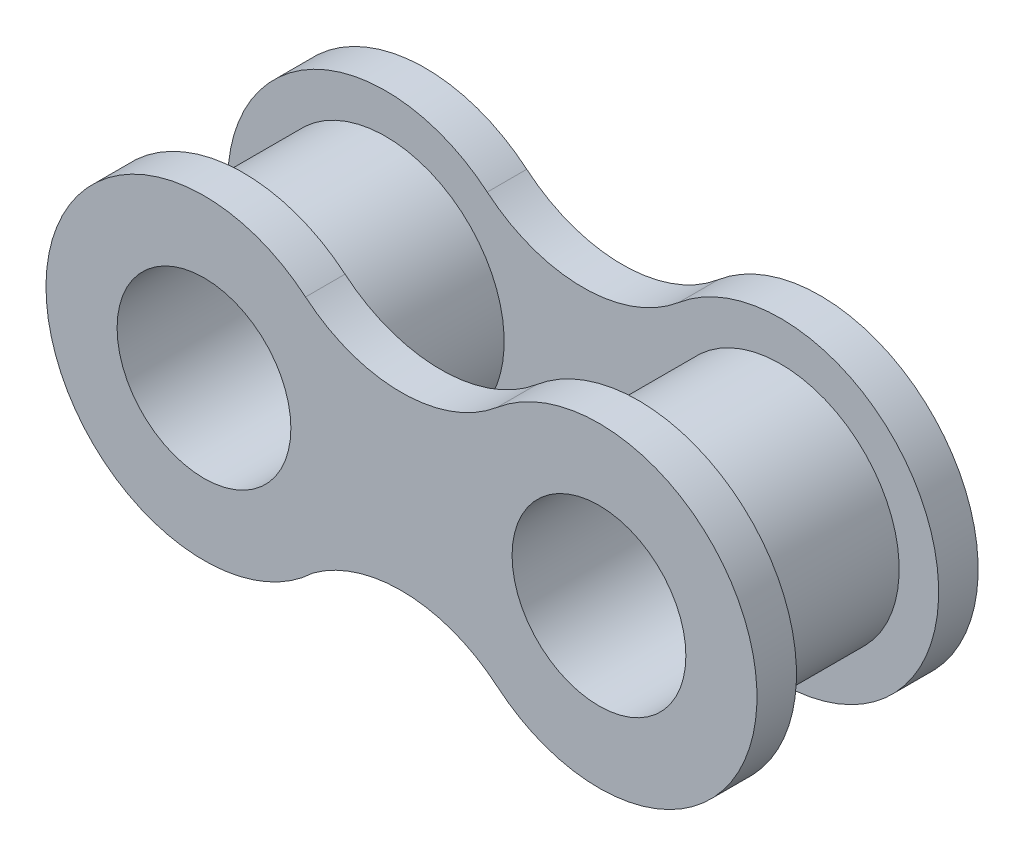
ISO-10303-21;
HEADER;
FILE_DESCRIPTION(('STEP AP214'),'2;1');
FILE_NAME('part.step','',(''),(''),'','','');
FILE_SCHEMA(('AUTOMOTIVE_DESIGN { 1 0 10303 214 1 1 1 1 }'));
ENDSEC;
DATA;
#1=APPLICATION_CONTEXT('core data for automotive mechanical design processes');
#2=APPLICATION_PROTOCOL_DEFINITION('international standard','automotive_design',2000,#1);
#3=PRODUCT_CONTEXT('',#1,'mechanical');
#4=PRODUCT('Part','Part','',(#3));
#5=PRODUCT_RELATED_PRODUCT_CATEGORY('part','',(#4));
#6=PRODUCT_DEFINITION_FORMATION('','',#4);
#7=PRODUCT_DEFINITION_CONTEXT('part definition',#1,'design');
#8=PRODUCT_DEFINITION('design','',#6,#7);
#9=PRODUCT_DEFINITION_SHAPE('','',#8);
#10=(LENGTH_UNIT() NAMED_UNIT(*) SI_UNIT(.MILLI.,.METRE.));
#11=(NAMED_UNIT(*) PLANE_ANGLE_UNIT() SI_UNIT($,.RADIAN.));
#12=(NAMED_UNIT(*) SI_UNIT($,.STERADIAN.) SOLID_ANGLE_UNIT());
#13=UNCERTAINTY_MEASURE_WITH_UNIT(LENGTH_MEASURE(1.E-05),#10,'distance_accuracy_value','');
#14=(GEOMETRIC_REPRESENTATION_CONTEXT(3) GLOBAL_UNCERTAINTY_ASSIGNED_CONTEXT((#13)) GLOBAL_UNIT_ASSIGNED_CONTEXT((#10,
#11,#12)) REPRESENTATION_CONTEXT('',''));
#15=CARTESIAN_POINT('',(0.,0.,0.));
#16=DIRECTION('',(0.,0.,1.));
#17=DIRECTION('',(1.,0.,0.));
#18=AXIS2_PLACEMENT_3D('',#15,#16,#17);
#19=CARTESIAN_POINT('',(-19.9369439531187,-13.6852790535894,1.27));
#20=DIRECTION('',(0.,0.,-1.));
#21=DIRECTION('',(-1.,0.,0.));
#22=AXIS2_PLACEMENT_3D('',#19,#20,#21);
#23=PLANE('',#22);
#24=CARTESIAN_POINT('',(-16.757896645419,-9.91445041401466,1.27));
#25=DIRECTION('',(0.,0.,-1.));
#26=DIRECTION('',(-1.,0.,0.));
#27=AXIS2_PLACEMENT_3D('',#24,#25,#26);
#28=CIRCLE('',#27,3.81);
#29=CARTESIAN_POINT('',(-20.567896645419,-9.91445041401466,1.27));
#30=VERTEX_POINT('',#29);
#31=EDGE_CURVE('E43',#30,#30,#28,.F.);
#32=ORIENTED_EDGE('',*,*,#31,.F.);
#33=EDGE_LOOP('',(#32));
#34=FACE_BOUND('',#33,.T.);
#35=CARTESIAN_POINT('',(-23.1159912608184,-17.4561076931641,1.27));
#36=DIRECTION('',(0.,0.,-1.));
#37=DIRECTION('',(-1.,0.,0.));
#38=AXIS2_PLACEMENT_3D('',#35,#36,#37);
#39=CIRCLE('',#38,4.784175670299);
#40=CARTESIAN_POINT('',(-25.9463960874436,-13.5990174217681,1.27));
#41=VERTEX_POINT('',#40);
#42=CARTESIAN_POINT('',(-20.0322828410624,-13.7983653257731,1.27));
#43=VERTEX_POINT('',#42);
#44=EDGE_CURVE('E162',#41,#43,#39,.T.);
#45=ORIENTED_EDGE('',*,*,#44,.T.);
#46=CARTESIAN_POINT('',(-16.757896645419,-9.91445041401466,1.27));
#47=DIRECTION('',(0.,0.,1.));
#48=DIRECTION('',(1.,0.,0.));
#49=AXIS2_PLACEMENT_3D('',#46,#47,#48);
#50=CIRCLE('',#49,5.08);
#51=CARTESIAN_POINT('',(-20.0322828410624,-6.03053550225622,1.27));
#52=VERTEX_POINT('',#51);
#53=EDGE_CURVE('E83',#43,#52,#50,.T.);
#54=ORIENTED_EDGE('',*,*,#53,.T.);
#55=CARTESIAN_POINT('',(-23.1159912608184,-2.37279313486525,1.27));
#56=DIRECTION('',(0.,0.,-1.));
#57=DIRECTION('',(1.,0.,0.));
#58=AXIS2_PLACEMENT_3D('',#55,#56,#57);
#59=CIRCLE('',#58,4.784175670299);
#60=CARTESIAN_POINT('',(-26.1918442760488,-6.03714370119743,1.27));
#61=VERTEX_POINT('',#60);
#62=EDGE_CURVE('E165',#52,#61,#59,.T.);
#63=ORIENTED_EDGE('',*,*,#62,.T.);
#64=CARTESIAN_POINT('',(-29.4578893367215,-9.9280754227335,1.27));
#65=DIRECTION('',(0.,0.,1.));
#66=DIRECTION('',(1.,0.,0.));
#67=AXIS2_PLACEMENT_3D('',#64,#65,#66);
#68=CIRCLE('',#67,5.08);
#69=EDGE_CURVE('E51',#61,#41,#68,.T.);
#70=ORIENTED_EDGE('',*,*,#69,.T.);
#71=EDGE_LOOP('',(#45,#54,#63,#70));
#72=FACE_BOUND('',#71,.T.);
#73=CARTESIAN_POINT('',(-29.4578893367215,-9.9280754227335,1.27));
#74=DIRECTION('',(0.,0.,-1.));
#75=DIRECTION('',(-1.,0.,0.));
#76=AXIS2_PLACEMENT_3D('',#73,#74,#75);
#77=CIRCLE('',#76,3.81);
#78=CARTESIAN_POINT('',(-33.2678893367215,-9.9280754227335,1.27));
#79=VERTEX_POINT('',#78);
#80=EDGE_CURVE('E11',#79,#79,#77,.F.);
#81=ORIENTED_EDGE('',*,*,#80,.F.);
#82=EDGE_LOOP('',(#81));
#83=FACE_BOUND('',#82,.T.);
#84=ADVANCED_FACE('F34',(#34,#72,#83),#23,.F.);
#85=CARTESIAN_POINT('',(-23.1159912608184,-17.4561076931641,1.27));
#86=DIRECTION('',(0.,0.,-1.));
#87=DIRECTION('',(-1.,0.,0.));
#88=AXIS2_PLACEMENT_3D('',#85,#86,#87);
#89=CYLINDRICAL_SURFACE('',#88,4.784175670299);
#90=CARTESIAN_POINT('',(-23.1159912608184,-17.4561076931641,0.));
#91=DIRECTION('',(0.,0.,-1.));
#92=DIRECTION('',(-1.,0.,0.));
#93=AXIS2_PLACEMENT_3D('',#90,#91,#92);
#94=CIRCLE('',#93,4.784175670299);
#95=CARTESIAN_POINT('',(-25.9463960874436,-13.5990174217681,0.));
#96=VERTEX_POINT('',#95);
#97=CARTESIAN_POINT('',(-20.0322828410624,-13.7983653257731,0.));
#98=VERTEX_POINT('',#97);
#99=EDGE_CURVE('E161',#96,#98,#94,.T.);
#100=ORIENTED_EDGE('',*,*,#99,.T.);
#101=DIRECTION('',(0.,0.,-1.));
#102=VECTOR('',#101,1.);
#103=CARTESIAN_POINT('',(-20.0322828410624,-13.7983653257731,1.27));
#104=LINE('',#103,#102);
#105=EDGE_CURVE('E180',#43,#98,#104,.T.);
#106=ORIENTED_EDGE('',*,*,#105,.F.);
#107=ORIENTED_EDGE('',*,*,#44,.F.);
#108=DIRECTION('',(0.,0.,-1.));
#109=VECTOR('',#108,1.);
#110=CARTESIAN_POINT('',(-25.9463960874436,-13.5990174217681,1.27));
#111=LINE('',#110,#109);
#112=EDGE_CURVE('E168',#41,#96,#111,.T.);
#113=ORIENTED_EDGE('',*,*,#112,.T.);
#114=EDGE_LOOP('',(#100,#106,#107,#113));
#115=FACE_BOUND('',#114,.T.);
#116=ADVANCED_FACE('F36',(#115),#89,.F.);
#117=CARTESIAN_POINT('',(-16.757896645419,-9.91445041401466,1.27));
#118=DIRECTION('',(0.,0.,-1.));
#119=DIRECTION('',(-1.,0.,0.));
#120=AXIS2_PLACEMENT_3D('',#117,#118,#119);
#121=CYLINDRICAL_SURFACE('',#120,5.08);
#122=CARTESIAN_POINT('',(-16.757896645419,-9.91445041401466,0.));
#123=DIRECTION('',(0.,0.,1.));
#124=DIRECTION('',(1.,0.,0.));
#125=AXIS2_PLACEMENT_3D('',#122,#123,#124);
#126=CIRCLE('',#125,5.08);
#127=CARTESIAN_POINT('',(-20.0322828410624,-6.03053550225622,0.));
#128=VERTEX_POINT('',#127);
#129=EDGE_CURVE('E171',#98,#128,#126,.T.);
#130=ORIENTED_EDGE('',*,*,#129,.T.);
#131=DIRECTION('',(0.,0.,-1.));
#132=VECTOR('',#131,1.);
#133=CARTESIAN_POINT('',(-20.0322828410624,-6.03053550225622,1.27));
#134=LINE('',#133,#132);
#135=EDGE_CURVE('E178',#52,#128,#134,.T.);
#136=ORIENTED_EDGE('',*,*,#135,.F.);
#137=ORIENTED_EDGE('',*,*,#53,.F.);
#138=ORIENTED_EDGE('',*,*,#105,.T.);
#139=EDGE_LOOP('',(#130,#136,#137,#138));
#140=FACE_BOUND('',#139,.T.);
#141=ADVANCED_FACE('F218',(#140),#121,.T.);
#142=CARTESIAN_POINT('',(-23.1159912608184,-2.37279313486525,1.27));
#143=DIRECTION('',(0.,0.,-1.));
#144=DIRECTION('',(-1.,0.,0.));
#145=AXIS2_PLACEMENT_3D('',#142,#143,#144);
#146=CYLINDRICAL_SURFACE('',#145,4.784175670299);
#147=CARTESIAN_POINT('',(-23.1159912608184,-2.37279313486525,0.));
#148=DIRECTION('',(0.,0.,-1.));
#149=DIRECTION('',(1.,0.,0.));
#150=AXIS2_PLACEMENT_3D('',#147,#148,#149);
#151=CIRCLE('',#150,4.784175670299);
#152=CARTESIAN_POINT('',(-26.1918442760488,-6.03714370119743,0.));
#153=VERTEX_POINT('',#152);
#154=EDGE_CURVE('E69',#128,#153,#151,.T.);
#155=ORIENTED_EDGE('',*,*,#154,.T.);
#156=DIRECTION('',(0.,0.,-1.));
#157=VECTOR('',#156,1.);
#158=CARTESIAN_POINT('',(-26.1918442760488,-6.03714370119743,1.27));
#159=LINE('',#158,#157);
#160=EDGE_CURVE('E176',#61,#153,#159,.T.);
#161=ORIENTED_EDGE('',*,*,#160,.F.);
#162=ORIENTED_EDGE('',*,*,#62,.F.);
#163=ORIENTED_EDGE('',*,*,#135,.T.);
#164=EDGE_LOOP('',(#155,#161,#162,#163));
#165=FACE_BOUND('',#164,.T.);
#166=ADVANCED_FACE('F216',(#165),#146,.F.);
#167=CARTESIAN_POINT('',(-29.4578893367215,-9.9280754227335,1.27));
#168=DIRECTION('',(0.,0.,-1.));
#169=DIRECTION('',(-1.,0.,0.));
#170=AXIS2_PLACEMENT_3D('',#167,#168,#169);
#171=CYLINDRICAL_SURFACE('',#170,5.08);
#172=CARTESIAN_POINT('',(-29.4578893367215,-9.9280754227335,0.));
#173=DIRECTION('',(0.,0.,1.));
#174=DIRECTION('',(1.,0.,0.));
#175=AXIS2_PLACEMENT_3D('',#172,#173,#174);
#176=CIRCLE('',#175,5.08);
#177=EDGE_CURVE('E75',#153,#96,#176,.T.);
#178=ORIENTED_EDGE('',*,*,#177,.T.);
#179=ORIENTED_EDGE('',*,*,#112,.F.);
#180=ORIENTED_EDGE('',*,*,#69,.F.);
#181=ORIENTED_EDGE('',*,*,#160,.T.);
#182=EDGE_LOOP('',(#178,#179,#180,#181));
#183=FACE_BOUND('',#182,.T.);
#184=ADVANCED_FACE('F212',(#183),#171,.T.);
#185=CARTESIAN_POINT('',(-19.9369439531187,-13.6852790535894,0.));
#186=DIRECTION('',(0.,0.,-1.));
#187=DIRECTION('',(-1.,0.,0.));
#188=AXIS2_PLACEMENT_3D('',#185,#186,#187);
#189=PLANE('',#188);
#190=CARTESIAN_POINT('',(-16.757896645419,-9.91445041401466,0.));
#191=DIRECTION('',(0.,0.,-1.));
#192=DIRECTION('',(-1.,0.,0.));
#193=AXIS2_PLACEMENT_3D('',#190,#191,#192);
#194=CIRCLE('',#193,2.794);
#195=CARTESIAN_POINT('',(-19.551896645419,-9.91445041401466,0.));
#196=VERTEX_POINT('',#195);
#197=EDGE_CURVE('E330',#196,#196,#194,.T.);
#198=ORIENTED_EDGE('',*,*,#197,.F.);
#199=EDGE_LOOP('',(#198));
#200=FACE_BOUND('',#199,.T.);
#201=CARTESIAN_POINT('',(-29.4578893367215,-9.9280754227335,0.));
#202=DIRECTION('',(0.,0.,-1.));
#203=DIRECTION('',(-1.,0.,0.));
#204=AXIS2_PLACEMENT_3D('',#201,#202,#203);
#205=CIRCLE('',#204,2.794);
#206=CARTESIAN_POINT('',(-32.2518893367215,-9.9280754227335,0.));
#207=VERTEX_POINT('',#206);
#208=EDGE_CURVE('E145',#207,#207,#205,.T.);
#209=ORIENTED_EDGE('',*,*,#208,.F.);
#210=EDGE_LOOP('',(#209));
#211=FACE_BOUND('',#210,.T.);
#212=ORIENTED_EDGE('',*,*,#99,.F.);
#213=ORIENTED_EDGE('',*,*,#177,.F.);
#214=ORIENTED_EDGE('',*,*,#154,.F.);
#215=ORIENTED_EDGE('',*,*,#129,.F.);
#216=EDGE_LOOP('',(#212,#213,#214,#215));
#217=FACE_BOUND('',#216,.T.);
#218=ADVANCED_FACE('F203',(#200,#211,#217),#189,.T.);
#219=CARTESIAN_POINT('',(-16.757896645419,-9.91445041401466,5.842));
#220=DIRECTION('',(0.,0.,-1.));
#221=DIRECTION('',(-1.,0.,0.));
#222=AXIS2_PLACEMENT_3D('',#219,#220,#221);
#223=CYLINDRICAL_SURFACE('',#222,3.81);
#224=CARTESIAN_POINT('',(-16.757896645419,-9.91445041401466,5.842));
#225=DIRECTION('',(0.,0.,1.));
#226=DIRECTION('',(1.,0.,0.));
#227=AXIS2_PLACEMENT_3D('',#224,#225,#226);
#228=CIRCLE('',#227,3.81);
#229=CARTESIAN_POINT('',(-12.947896645419,-9.91445041401466,5.842));
#230=VERTEX_POINT('',#229);
#231=EDGE_CURVE('E158',#230,#230,#228,.T.);
#232=ORIENTED_EDGE('',*,*,#231,.F.);
#233=EDGE_LOOP('',(#232));
#234=FACE_BOUND('',#233,.T.);
#235=ORIENTED_EDGE('',*,*,#31,.T.);
#236=EDGE_LOOP('',(#235));
#237=FACE_BOUND('',#236,.T.);
#238=ADVANCED_FACE('F184',(#234,#237),#223,.T.);
#239=CARTESIAN_POINT('',(-29.4578893367215,-9.9280754227335,5.842));
#240=DIRECTION('',(0.,0.,-1.));
#241=DIRECTION('',(-1.,0.,0.));
#242=AXIS2_PLACEMENT_3D('',#239,#240,#241);
#243=CYLINDRICAL_SURFACE('',#242,3.81);
#244=CARTESIAN_POINT('',(-29.4578893367215,-9.9280754227335,5.842));
#245=DIRECTION('',(0.,0.,1.));
#246=DIRECTION('',(1.,0.,0.));
#247=AXIS2_PLACEMENT_3D('',#244,#245,#246);
#248=CIRCLE('',#247,3.81);
#249=CARTESIAN_POINT('',(-25.6478893367215,-9.9280754227335,5.842));
#250=VERTEX_POINT('',#249);
#251=EDGE_CURVE('E121',#250,#250,#248,.T.);
#252=ORIENTED_EDGE('',*,*,#251,.F.);
#253=EDGE_LOOP('',(#252));
#254=FACE_BOUND('',#253,.T.);
#255=ORIENTED_EDGE('',*,*,#80,.T.);
#256=EDGE_LOOP('',(#255));
#257=FACE_BOUND('',#256,.T.);
#258=ADVANCED_FACE('F193',(#254,#257),#243,.T.);
#259=CARTESIAN_POINT('',(-19.9369439531187,-13.6852790535894,5.842));
#260=DIRECTION('',(0.,0.,1.));
#261=DIRECTION('',(-1.,0.,0.));
#262=AXIS2_PLACEMENT_3D('',#259,#260,#261);
#263=PLANE('',#262);
#264=ORIENTED_EDGE('',*,*,#251,.T.);
#265=EDGE_LOOP('',(#264));
#266=FACE_BOUND('',#265,.T.);
#267=CARTESIAN_POINT('',(-23.1159912608184,-17.4561076931641,5.842));
#268=DIRECTION('',(0.,0.,-1.));
#269=DIRECTION('',(-1.,0.,0.));
#270=AXIS2_PLACEMENT_3D('',#267,#268,#269);
#271=CIRCLE('',#270,4.784175670299);
#272=CARTESIAN_POINT('',(-25.9463960874436,-13.5990174217681,5.842));
#273=VERTEX_POINT('',#272);
#274=CARTESIAN_POINT('',(-20.0322828410624,-13.7983653257731,5.842));
#275=VERTEX_POINT('',#274);
#276=EDGE_CURVE('E113',#273,#275,#271,.T.);
#277=ORIENTED_EDGE('',*,*,#276,.F.);
#278=CARTESIAN_POINT('',(-29.4578893367215,-9.9280754227335,5.842));
#279=DIRECTION('',(0.,0.,1.));
#280=DIRECTION('',(1.,0.,0.));
#281=AXIS2_PLACEMENT_3D('',#278,#279,#280);
#282=CIRCLE('',#281,5.08);
#283=CARTESIAN_POINT('',(-26.1918442760488,-6.03714370119743,5.842));
#284=VERTEX_POINT('',#283);
#285=EDGE_CURVE('E129',#284,#273,#282,.T.);
#286=ORIENTED_EDGE('',*,*,#285,.F.);
#287=CARTESIAN_POINT('',(-23.1159912608184,-2.37279313486525,5.842));
#288=DIRECTION('',(0.,0.,-1.));
#289=DIRECTION('',(1.,0.,0.));
#290=AXIS2_PLACEMENT_3D('',#287,#288,#289);
#291=CIRCLE('',#290,4.784175670299);
#292=CARTESIAN_POINT('',(-20.0322828410624,-6.03053550225622,5.842));
#293=VERTEX_POINT('',#292);
#294=EDGE_CURVE('E136',#293,#284,#291,.T.);
#295=ORIENTED_EDGE('',*,*,#294,.F.);
#296=CARTESIAN_POINT('',(-16.757896645419,-9.91445041401466,5.842));
#297=DIRECTION('',(0.,0.,1.));
#298=DIRECTION('',(1.,0.,0.));
#299=AXIS2_PLACEMENT_3D('',#296,#297,#298);
#300=CIRCLE('',#299,5.08);
#301=EDGE_CURVE('E132',#275,#293,#300,.T.);
#302=ORIENTED_EDGE('',*,*,#301,.F.);
#303=EDGE_LOOP('',(#277,#286,#295,#302));
#304=FACE_BOUND('',#303,.T.);
#305=ORIENTED_EDGE('',*,*,#231,.T.);
#306=EDGE_LOOP('',(#305));
#307=FACE_BOUND('',#306,.T.);
#308=ADVANCED_FACE('F126',(#266,#304,#307),#263,.F.);
#309=CARTESIAN_POINT('',(-23.1159912608184,-17.4561076931641,5.842));
#310=DIRECTION('',(0.,0.,1.));
#311=DIRECTION('',(1.,0.,0.));
#312=AXIS2_PLACEMENT_3D('',#309,#310,#311);
#313=CYLINDRICAL_SURFACE('',#312,4.784175670299);
#314=CARTESIAN_POINT('',(-23.1159912608184,-17.4561076931641,7.112));
#315=DIRECTION('',(0.,0.,-1.));
#316=DIRECTION('',(-1.,0.,0.));
#317=AXIS2_PLACEMENT_3D('',#314,#315,#316);
#318=CIRCLE('',#317,4.784175670299);
#319=CARTESIAN_POINT('',(-25.9463960874436,-13.5990174217681,7.112));
#320=VERTEX_POINT('',#319);
#321=CARTESIAN_POINT('',(-20.0322828410624,-13.7983653257731,7.112));
#322=VERTEX_POINT('',#321);
#323=EDGE_CURVE('E116',#320,#322,#318,.T.);
#324=ORIENTED_EDGE('',*,*,#323,.F.);
#325=DIRECTION('',(0.,0.,1.));
#326=VECTOR('',#325,1.);
#327=CARTESIAN_POINT('',(-25.9463960874436,-13.5990174217681,5.842));
#328=LINE('',#327,#326);
#329=EDGE_CURVE('E110',#273,#320,#328,.T.);
#330=ORIENTED_EDGE('',*,*,#329,.F.);
#331=ORIENTED_EDGE('',*,*,#276,.T.);
#332=DIRECTION('',(0.,0.,1.));
#333=VECTOR('',#332,1.);
#334=CARTESIAN_POINT('',(-20.0322828410624,-13.7983653257731,5.842));
#335=LINE('',#334,#333);
#336=EDGE_CURVE('E142',#275,#322,#335,.T.);
#337=ORIENTED_EDGE('',*,*,#336,.T.);
#338=EDGE_LOOP('',(#324,#330,#331,#337));
#339=FACE_BOUND('',#338,.T.);
#340=ADVANCED_FACE('F112',(#339),#313,.F.);
#341=CARTESIAN_POINT('',(-29.4578893367215,-9.9280754227335,5.842));
#342=DIRECTION('',(0.,0.,1.));
#343=DIRECTION('',(1.,0.,0.));
#344=AXIS2_PLACEMENT_3D('',#341,#342,#343);
#345=CYLINDRICAL_SURFACE('',#344,5.08);
#346=CARTESIAN_POINT('',(-29.4578893367215,-9.9280754227335,7.112));
#347=DIRECTION('',(0.,0.,1.));
#348=DIRECTION('',(1.,0.,0.));
#349=AXIS2_PLACEMENT_3D('',#346,#347,#348);
#350=CIRCLE('',#349,5.08);
#351=CARTESIAN_POINT('',(-26.1918442760488,-6.03714370119743,7.112));
#352=VERTEX_POINT('',#351);
#353=EDGE_CURVE('E144',#352,#320,#350,.T.);
#354=ORIENTED_EDGE('',*,*,#353,.F.);
#355=DIRECTION('',(0.,0.,1.));
#356=VECTOR('',#355,1.);
#357=CARTESIAN_POINT('',(-26.1918442760488,-6.03714370119743,5.842));
#358=LINE('',#357,#356);
#359=EDGE_CURVE('E122',#284,#352,#358,.T.);
#360=ORIENTED_EDGE('',*,*,#359,.F.);
#361=ORIENTED_EDGE('',*,*,#285,.T.);
#362=ORIENTED_EDGE('',*,*,#329,.T.);
#363=EDGE_LOOP('',(#354,#360,#361,#362));
#364=FACE_BOUND('',#363,.T.);
#365=ADVANCED_FACE('F135',(#364),#345,.T.);
#366=CARTESIAN_POINT('',(-23.1159912608184,-2.37279313486525,5.842));
#367=DIRECTION('',(0.,0.,1.));
#368=DIRECTION('',(1.,0.,0.));
#369=AXIS2_PLACEMENT_3D('',#366,#367,#368);
#370=CYLINDRICAL_SURFACE('',#369,4.784175670299);
#371=CARTESIAN_POINT('',(-23.1159912608184,-2.37279313486525,7.112));
#372=DIRECTION('',(0.,0.,-1.));
#373=DIRECTION('',(1.,0.,0.));
#374=AXIS2_PLACEMENT_3D('',#371,#372,#373);
#375=CIRCLE('',#374,4.784175670299);
#376=CARTESIAN_POINT('',(-20.0322828410624,-6.03053550225622,7.112));
#377=VERTEX_POINT('',#376);
#378=EDGE_CURVE('E147',#377,#352,#375,.T.);
#379=ORIENTED_EDGE('',*,*,#378,.F.);
#380=DIRECTION('',(0.,0.,1.));
#381=VECTOR('',#380,1.);
#382=CARTESIAN_POINT('',(-20.0322828410624,-6.03053550225622,5.842));
#383=LINE('',#382,#381);
#384=EDGE_CURVE('E153',#293,#377,#383,.T.);
#385=ORIENTED_EDGE('',*,*,#384,.F.);
#386=ORIENTED_EDGE('',*,*,#294,.T.);
#387=ORIENTED_EDGE('',*,*,#359,.T.);
#388=EDGE_LOOP('',(#379,#385,#386,#387));
#389=FACE_BOUND('',#388,.T.);
#390=ADVANCED_FACE('F270',(#389),#370,.F.);
#391=CARTESIAN_POINT('',(-16.757896645419,-9.91445041401466,5.842));
#392=DIRECTION('',(0.,0.,1.));
#393=DIRECTION('',(1.,0.,0.));
#394=AXIS2_PLACEMENT_3D('',#391,#392,#393);
#395=CYLINDRICAL_SURFACE('',#394,5.08);
#396=CARTESIAN_POINT('',(-16.757896645419,-9.91445041401466,7.112));
#397=DIRECTION('',(0.,0.,1.));
#398=DIRECTION('',(1.,0.,0.));
#399=AXIS2_PLACEMENT_3D('',#396,#397,#398);
#400=CIRCLE('',#399,5.08);
#401=EDGE_CURVE('E133',#322,#377,#400,.T.);
#402=ORIENTED_EDGE('',*,*,#401,.F.);
#403=ORIENTED_EDGE('',*,*,#336,.F.);
#404=ORIENTED_EDGE('',*,*,#301,.T.);
#405=ORIENTED_EDGE('',*,*,#384,.T.);
#406=EDGE_LOOP('',(#402,#403,#404,#405));
#407=FACE_BOUND('',#406,.T.);
#408=ADVANCED_FACE('F278',(#407),#395,.T.);
#409=CARTESIAN_POINT('',(-19.9369439531187,-13.6852790535894,7.112));
#410=DIRECTION('',(0.,0.,1.));
#411=DIRECTION('',(-1.,0.,0.));
#412=AXIS2_PLACEMENT_3D('',#409,#410,#411);
#413=PLANE('',#412);
#414=CARTESIAN_POINT('',(-16.757896645419,-9.91445041401466,7.112));
#415=DIRECTION('',(0.,0.,1.));
#416=DIRECTION('',(1.,0.,0.));
#417=AXIS2_PLACEMENT_3D('',#414,#415,#416);
#418=CIRCLE('',#417,2.794);
#419=CARTESIAN_POINT('',(-13.963896645419,-9.91445041401466,7.112));
#420=VERTEX_POINT('',#419);
#421=EDGE_CURVE('E333',#420,#420,#418,.T.);
#422=ORIENTED_EDGE('',*,*,#421,.F.);
#423=EDGE_LOOP('',(#422));
#424=FACE_BOUND('',#423,.T.);
#425=CARTESIAN_POINT('',(-29.4578893367215,-9.9280754227335,7.112));
#426=DIRECTION('',(0.,0.,1.));
#427=DIRECTION('',(1.,0.,0.));
#428=AXIS2_PLACEMENT_3D('',#425,#426,#427);
#429=CIRCLE('',#428,2.794);
#430=CARTESIAN_POINT('',(-26.6638893367215,-9.9280754227335,7.112));
#431=VERTEX_POINT('',#430);
#432=EDGE_CURVE('E335',#431,#431,#429,.T.);
#433=ORIENTED_EDGE('',*,*,#432,.F.);
#434=EDGE_LOOP('',(#433));
#435=FACE_BOUND('',#434,.T.);
#436=ORIENTED_EDGE('',*,*,#323,.T.);
#437=ORIENTED_EDGE('',*,*,#401,.T.);
#438=ORIENTED_EDGE('',*,*,#378,.T.);
#439=ORIENTED_EDGE('',*,*,#353,.T.);
#440=EDGE_LOOP('',(#436,#437,#438,#439));
#441=FACE_BOUND('',#440,.T.);
#442=ADVANCED_FACE('F288',(#424,#435,#441),#413,.T.);
#443=CARTESIAN_POINT('',(-29.4578893367215,-9.9280754227335,-17.526));
#444=DIRECTION('',(0.,0.,1.));
#445=DIRECTION('',(1.,0.,0.));
#446=AXIS2_PLACEMENT_3D('',#443,#444,#445);
#447=CYLINDRICAL_SURFACE('',#446,2.794);
#448=ORIENTED_EDGE('',*,*,#208,.T.);
#449=EDGE_LOOP('',(#448));
#450=FACE_BOUND('',#449,.T.);
#451=ORIENTED_EDGE('',*,*,#432,.T.);
#452=EDGE_LOOP('',(#451));
#453=FACE_BOUND('',#452,.T.);
#454=ADVANCED_FACE('F303',(#450,#453),#447,.F.);
#455=CARTESIAN_POINT('',(-16.757896645419,-9.91445041401466,-17.526));
#456=DIRECTION('',(0.,0.,1.));
#457=DIRECTION('',(1.,0.,0.));
#458=AXIS2_PLACEMENT_3D('',#455,#456,#457);
#459=CYLINDRICAL_SURFACE('',#458,2.794);
#460=ORIENTED_EDGE('',*,*,#197,.T.);
#461=EDGE_LOOP('',(#460));
#462=FACE_BOUND('',#461,.T.);
#463=ORIENTED_EDGE('',*,*,#421,.T.);
#464=EDGE_LOOP('',(#463));
#465=FACE_BOUND('',#464,.T.);
#466=ADVANCED_FACE('F313',(#462,#465),#459,.F.);
#467=CLOSED_SHELL('',(#84,#116,#141,#166,#184,#218,#238,#258,#308,#340,#365,#390,#408,#442,#454,#466));
#468=MANIFOLD_SOLID_BREP('B2',#467);
#469=ADVANCED_BREP_SHAPE_REPRESENTATION('',(#18,#468),#14);
#470=SHAPE_DEFINITION_REPRESENTATION(#9,#469);
ENDSEC;
END-ISO-10303-21;
